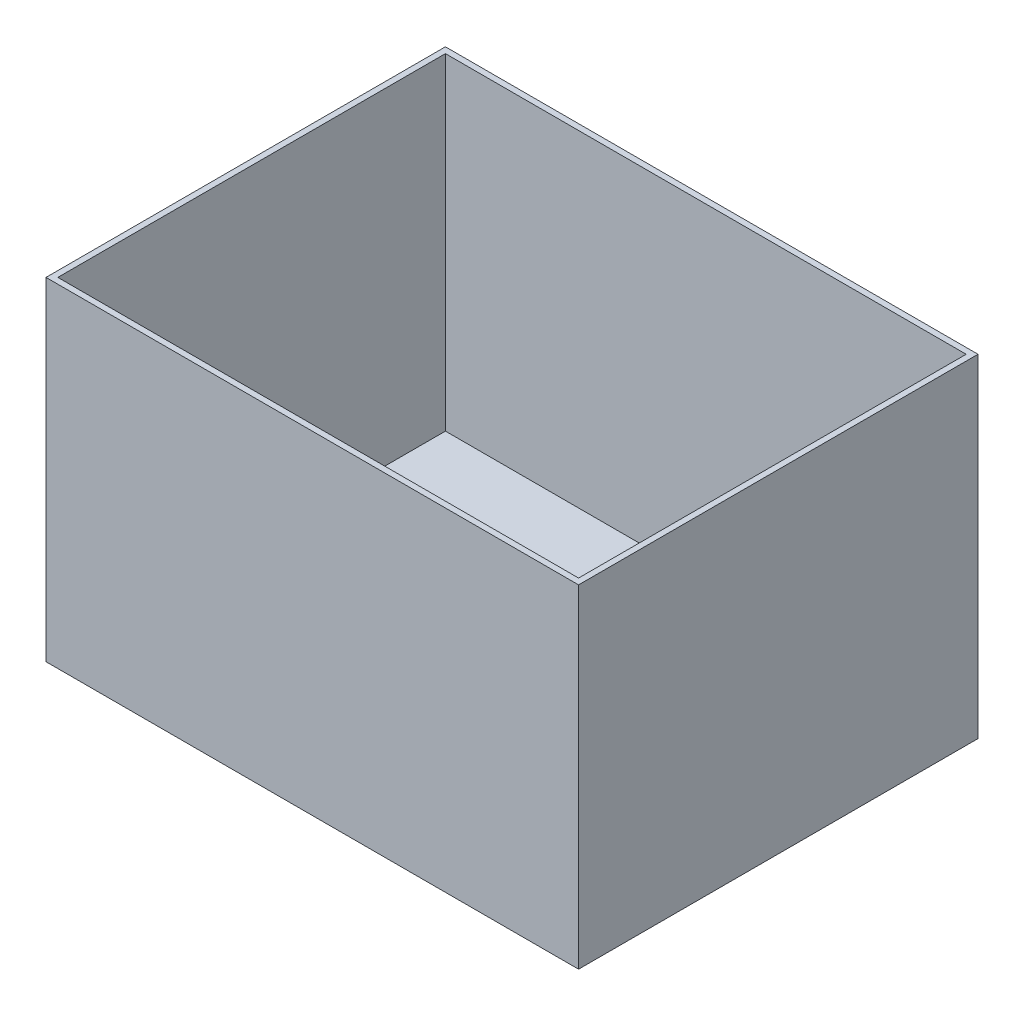
ISO-10303-21;
HEADER;
FILE_DESCRIPTION(('STEP AP214'),'2;1');
FILE_NAME('part.step','',(''),(''),'','','');
FILE_SCHEMA(('AUTOMOTIVE_DESIGN { 1 0 10303 214 1 1 1 1 }'));
ENDSEC;
DATA;
#1=APPLICATION_CONTEXT('core data for automotive mechanical design processes');
#2=APPLICATION_PROTOCOL_DEFINITION('international standard','automotive_design',2000,#1);
#3=PRODUCT_CONTEXT('',#1,'mechanical');
#4=PRODUCT('Part','Part','',(#3));
#5=PRODUCT_RELATED_PRODUCT_CATEGORY('part','',(#4));
#6=PRODUCT_DEFINITION_FORMATION('','',#4);
#7=PRODUCT_DEFINITION_CONTEXT('part definition',#1,'design');
#8=PRODUCT_DEFINITION('design','',#6,#7);
#9=PRODUCT_DEFINITION_SHAPE('','',#8);
#10=(LENGTH_UNIT() NAMED_UNIT(*) SI_UNIT(.MILLI.,.METRE.));
#11=(NAMED_UNIT(*) PLANE_ANGLE_UNIT() SI_UNIT($,.RADIAN.));
#12=(NAMED_UNIT(*) SI_UNIT($,.STERADIAN.) SOLID_ANGLE_UNIT());
#13=UNCERTAINTY_MEASURE_WITH_UNIT(LENGTH_MEASURE(1.E-05),#10,'distance_accuracy_value','');
#14=(GEOMETRIC_REPRESENTATION_CONTEXT(3) GLOBAL_UNCERTAINTY_ASSIGNED_CONTEXT((#13)) GLOBAL_UNIT_ASSIGNED_CONTEXT((#10,
#11,#12)) REPRESENTATION_CONTEXT('',''));
#15=CARTESIAN_POINT('',(0.,0.,0.));
#16=DIRECTION('',(0.,0.,1.));
#17=DIRECTION('',(1.,0.,0.));
#18=AXIS2_PLACEMENT_3D('',#15,#16,#17);
#19=CARTESIAN_POINT('',(180.,112.5,-135.));
#20=DIRECTION('',(1.,0.,0.));
#21=DIRECTION('',(0.,0.,-1.));
#22=AXIS2_PLACEMENT_3D('',#19,#20,#21);
#23=PLANE('',#22);
#24=DIRECTION('',(0.,0.,1.));
#25=VECTOR('',#24,1.);
#26=CARTESIAN_POINT('',(180.,112.5,-135.));
#27=LINE('',#26,#25);
#28=CARTESIAN_POINT('',(180.,112.5,-135.));
#29=VERTEX_POINT('',#28);
#30=CARTESIAN_POINT('',(180.,112.5,135.));
#31=VERTEX_POINT('',#30);
#32=EDGE_CURVE('E44',#29,#31,#27,.T.);
#33=ORIENTED_EDGE('',*,*,#32,.T.);
#34=DIRECTION('',(0.,1.,0.));
#35=VECTOR('',#34,1.);
#36=CARTESIAN_POINT('',(180.,112.5,135.));
#37=LINE('',#36,#35);
#38=CARTESIAN_POINT('',(180.,-112.5,135.));
#39=VERTEX_POINT('',#38);
#40=EDGE_CURVE('E116',#39,#31,#37,.T.);
#41=ORIENTED_EDGE('',*,*,#40,.F.);
#42=DIRECTION('',(0.,0.,1.));
#43=VECTOR('',#42,1.);
#44=CARTESIAN_POINT('',(180.,-112.5,-135.));
#45=LINE('',#44,#43);
#46=CARTESIAN_POINT('',(180.,-112.5,-135.));
#47=VERTEX_POINT('',#46);
#48=EDGE_CURVE('E11',#47,#39,#45,.T.);
#49=ORIENTED_EDGE('',*,*,#48,.F.);
#50=DIRECTION('',(0.,1.,0.));
#51=VECTOR('',#50,1.);
#52=CARTESIAN_POINT('',(180.,112.5,-135.));
#53=LINE('',#52,#51);
#54=EDGE_CURVE('E155',#47,#29,#53,.T.);
#55=ORIENTED_EDGE('',*,*,#54,.T.);
#56=EDGE_LOOP('',(#33,#41,#49,#55));
#57=FACE_BOUND('',#56,.T.);
#58=ADVANCED_FACE('F41',(#57),#23,.T.);
#59=CARTESIAN_POINT('',(-180.,-112.5,-135.));
#60=DIRECTION('',(0.,-1.,0.));
#61=DIRECTION('',(0.,0.,-1.));
#62=AXIS2_PLACEMENT_3D('',#59,#60,#61);
#63=PLANE('',#62);
#64=ORIENTED_EDGE('',*,*,#48,.T.);
#65=DIRECTION('',(1.,0.,0.));
#66=VECTOR('',#65,1.);
#67=CARTESIAN_POINT('',(-180.,-112.5,135.));
#68=LINE('',#67,#66);
#69=CARTESIAN_POINT('',(-180.,-112.5,135.));
#70=VERTEX_POINT('',#69);
#71=EDGE_CURVE('E152',#70,#39,#68,.T.);
#72=ORIENTED_EDGE('',*,*,#71,.F.);
#73=DIRECTION('',(0.,0.,1.));
#74=VECTOR('',#73,1.);
#75=CARTESIAN_POINT('',(-180.,-112.5,-135.));
#76=LINE('',#75,#74);
#77=CARTESIAN_POINT('',(-180.,-112.5,-135.));
#78=VERTEX_POINT('',#77);
#79=EDGE_CURVE('E49',#78,#70,#76,.T.);
#80=ORIENTED_EDGE('',*,*,#79,.F.);
#81=DIRECTION('',(1.,0.,0.));
#82=VECTOR('',#81,1.);
#83=CARTESIAN_POINT('',(-180.,-112.5,-135.));
#84=LINE('',#83,#82);
#85=EDGE_CURVE('E163',#78,#47,#84,.T.);
#86=ORIENTED_EDGE('',*,*,#85,.T.);
#87=EDGE_LOOP('',(#64,#72,#80,#86));
#88=FACE_BOUND('',#87,.T.);
#89=ADVANCED_FACE('F176',(#88),#63,.T.);
#90=CARTESIAN_POINT('',(-180.,112.5,-135.));
#91=DIRECTION('',(-1.,0.,0.));
#92=DIRECTION('',(0.,-1.,0.));
#93=AXIS2_PLACEMENT_3D('',#90,#91,#92);
#94=PLANE('',#93);
#95=ORIENTED_EDGE('',*,*,#79,.T.);
#96=DIRECTION('',(0.,-1.,0.));
#97=VECTOR('',#96,1.);
#98=CARTESIAN_POINT('',(-180.,112.5,135.));
#99=LINE('',#98,#97);
#100=CARTESIAN_POINT('',(-180.,112.5,135.));
#101=VERTEX_POINT('',#100);
#102=EDGE_CURVE('E149',#101,#70,#99,.T.);
#103=ORIENTED_EDGE('',*,*,#102,.F.);
#104=DIRECTION('',(0.,0.,1.));
#105=VECTOR('',#104,1.);
#106=CARTESIAN_POINT('',(-180.,112.5,-135.));
#107=LINE('',#106,#105);
#108=CARTESIAN_POINT('',(-180.,112.5,-135.));
#109=VERTEX_POINT('',#108);
#110=EDGE_CURVE('E166',#109,#101,#107,.T.);
#111=ORIENTED_EDGE('',*,*,#110,.F.);
#112=DIRECTION('',(0.,-1.,0.));
#113=VECTOR('',#112,1.);
#114=CARTESIAN_POINT('',(-180.,112.5,-135.));
#115=LINE('',#114,#113);
#116=EDGE_CURVE('E160',#109,#78,#115,.T.);
#117=ORIENTED_EDGE('',*,*,#116,.T.);
#118=EDGE_LOOP('',(#95,#103,#111,#117));
#119=FACE_BOUND('',#118,.T.);
#120=ADVANCED_FACE('F182',(#119),#94,.T.);
#121=CARTESIAN_POINT('',(-180.,112.5,-135.));
#122=DIRECTION('',(0.,1.,0.));
#123=DIRECTION('',(0.,0.,1.));
#124=AXIS2_PLACEMENT_3D('',#121,#122,#123);
#125=PLANE('',#124);
#126=DIRECTION('',(0.,0.,1.));
#127=VECTOR('',#126,1.);
#128=CARTESIAN_POINT('',(-176.,112.5,-135.));
#129=LINE('',#128,#127);
#130=CARTESIAN_POINT('',(-176.,112.5,-131.));
#131=VERTEX_POINT('',#130);
#132=CARTESIAN_POINT('',(-176.,112.5,131.));
#133=VERTEX_POINT('',#132);
#134=EDGE_CURVE('E129',#131,#133,#129,.T.);
#135=ORIENTED_EDGE('',*,*,#134,.F.);
#136=DIRECTION('',(-1.,0.,0.));
#137=VECTOR('',#136,1.);
#138=CARTESIAN_POINT('',(0.,112.5,-131.));
#139=LINE('',#138,#137);
#140=CARTESIAN_POINT('',(176.,112.5,-131.));
#141=VERTEX_POINT('',#140);
#142=EDGE_CURVE('E123',#141,#131,#139,.T.);
#143=ORIENTED_EDGE('',*,*,#142,.F.);
#144=DIRECTION('',(0.,0.,1.));
#145=VECTOR('',#144,1.);
#146=CARTESIAN_POINT('',(176.,112.5,-135.));
#147=LINE('',#146,#145);
#148=CARTESIAN_POINT('',(176.,112.5,131.));
#149=VERTEX_POINT('',#148);
#150=EDGE_CURVE('E121',#141,#149,#147,.T.);
#151=ORIENTED_EDGE('',*,*,#150,.T.);
#152=DIRECTION('',(-1.,0.,0.));
#153=VECTOR('',#152,1.);
#154=CARTESIAN_POINT('',(0.,112.5,131.));
#155=LINE('',#154,#153);
#156=EDGE_CURVE('E137',#149,#133,#155,.T.);
#157=ORIENTED_EDGE('',*,*,#156,.T.);
#158=EDGE_LOOP('',(#135,#143,#151,#157));
#159=FACE_BOUND('',#158,.T.);
#160=ORIENTED_EDGE('',*,*,#110,.T.);
#161=DIRECTION('',(-1.,0.,0.));
#162=VECTOR('',#161,1.);
#163=CARTESIAN_POINT('',(-180.,112.5,135.));
#164=LINE('',#163,#162);
#165=EDGE_CURVE('E146',#31,#101,#164,.T.);
#166=ORIENTED_EDGE('',*,*,#165,.F.);
#167=ORIENTED_EDGE('',*,*,#32,.F.);
#168=DIRECTION('',(-1.,0.,0.));
#169=VECTOR('',#168,1.);
#170=CARTESIAN_POINT('',(-180.,112.5,-135.));
#171=LINE('',#170,#169);
#172=EDGE_CURVE('E157',#29,#109,#171,.T.);
#173=ORIENTED_EDGE('',*,*,#172,.T.);
#174=EDGE_LOOP('',(#160,#166,#167,#173));
#175=FACE_BOUND('',#174,.T.);
#176=ADVANCED_FACE('F170',(#159,#175),#125,.T.);
#177=CARTESIAN_POINT('',(0.,0.,-135.));
#178=DIRECTION('',(0.,0.,1.));
#179=DIRECTION('',(1.,0.,0.));
#180=AXIS2_PLACEMENT_3D('',#177,#178,#179);
#181=PLANE('',#180);
#182=ORIENTED_EDGE('',*,*,#54,.F.);
#183=ORIENTED_EDGE('',*,*,#85,.F.);
#184=ORIENTED_EDGE('',*,*,#116,.F.);
#185=ORIENTED_EDGE('',*,*,#172,.F.);
#186=EDGE_LOOP('',(#182,#183,#184,#185));
#187=FACE_BOUND('',#186,.T.);
#188=ADVANCED_FACE('F180',(#187),#181,.F.);
#189=CARTESIAN_POINT('',(0.,0.,135.));
#190=DIRECTION('',(0.,0.,1.));
#191=DIRECTION('',(1.,0.,0.));
#192=AXIS2_PLACEMENT_3D('',#189,#190,#191);
#193=PLANE('',#192);
#194=ORIENTED_EDGE('',*,*,#40,.T.);
#195=ORIENTED_EDGE('',*,*,#165,.T.);
#196=ORIENTED_EDGE('',*,*,#102,.T.);
#197=ORIENTED_EDGE('',*,*,#71,.T.);
#198=EDGE_LOOP('',(#194,#195,#196,#197));
#199=FACE_BOUND('',#198,.T.);
#200=ADVANCED_FACE('F173',(#199),#193,.T.);
#201=CARTESIAN_POINT('',(176.,112.5,-135.));
#202=DIRECTION('',(1.,0.,0.));
#203=DIRECTION('',(0.,0.,-1.));
#204=AXIS2_PLACEMENT_3D('',#201,#202,#203);
#205=PLANE('',#204);
#206=ORIENTED_EDGE('',*,*,#150,.F.);
#207=DIRECTION('',(0.,1.,0.));
#208=VECTOR('',#207,1.);
#209=CARTESIAN_POINT('',(176.,0.,-131.));
#210=LINE('',#209,#208);
#211=CARTESIAN_POINT('',(176.,-108.5,-131.));
#212=VERTEX_POINT('',#211);
#213=EDGE_CURVE('E57',#212,#141,#210,.T.);
#214=ORIENTED_EDGE('',*,*,#213,.F.);
#215=DIRECTION('',(0.,0.,1.));
#216=VECTOR('',#215,1.);
#217=CARTESIAN_POINT('',(176.,-108.5,-135.));
#218=LINE('',#217,#216);
#219=CARTESIAN_POINT('',(176.,-108.5,131.));
#220=VERTEX_POINT('',#219);
#221=EDGE_CURVE('E108',#212,#220,#218,.T.);
#222=ORIENTED_EDGE('',*,*,#221,.T.);
#223=DIRECTION('',(0.,1.,0.));
#224=VECTOR('',#223,1.);
#225=CARTESIAN_POINT('',(176.,0.,131.));
#226=LINE('',#225,#224);
#227=EDGE_CURVE('E143',#220,#149,#226,.T.);
#228=ORIENTED_EDGE('',*,*,#227,.T.);
#229=EDGE_LOOP('',(#206,#214,#222,#228));
#230=FACE_BOUND('',#229,.T.);
#231=ADVANCED_FACE('F119',(#230),#205,.F.);
#232=CARTESIAN_POINT('',(-180.,-108.5,-135.));
#233=DIRECTION('',(0.,-1.,0.));
#234=DIRECTION('',(0.,0.,-1.));
#235=AXIS2_PLACEMENT_3D('',#232,#233,#234);
#236=PLANE('',#235);
#237=ORIENTED_EDGE('',*,*,#221,.F.);
#238=DIRECTION('',(1.,0.,0.));
#239=VECTOR('',#238,1.);
#240=CARTESIAN_POINT('',(0.,-108.5,-131.));
#241=LINE('',#240,#239);
#242=CARTESIAN_POINT('',(-176.,-108.5,-131.));
#243=VERTEX_POINT('',#242);
#244=EDGE_CURVE('E110',#243,#212,#241,.T.);
#245=ORIENTED_EDGE('',*,*,#244,.F.);
#246=DIRECTION('',(0.,0.,1.));
#247=VECTOR('',#246,1.);
#248=CARTESIAN_POINT('',(-176.,-108.5,-135.));
#249=LINE('',#248,#247);
#250=CARTESIAN_POINT('',(-176.,-108.5,131.));
#251=VERTEX_POINT('',#250);
#252=EDGE_CURVE('E117',#243,#251,#249,.T.);
#253=ORIENTED_EDGE('',*,*,#252,.T.);
#254=DIRECTION('',(1.,0.,0.));
#255=VECTOR('',#254,1.);
#256=CARTESIAN_POINT('',(0.,-108.5,131.));
#257=LINE('',#256,#255);
#258=EDGE_CURVE('E112',#251,#220,#257,.T.);
#259=ORIENTED_EDGE('',*,*,#258,.T.);
#260=EDGE_LOOP('',(#237,#245,#253,#259));
#261=FACE_BOUND('',#260,.T.);
#262=ADVANCED_FACE('F109',(#261),#236,.F.);
#263=CARTESIAN_POINT('',(-176.,112.5,-135.));
#264=DIRECTION('',(-1.,0.,0.));
#265=DIRECTION('',(0.,-1.,0.));
#266=AXIS2_PLACEMENT_3D('',#263,#264,#265);
#267=PLANE('',#266);
#268=ORIENTED_EDGE('',*,*,#252,.F.);
#269=DIRECTION('',(0.,-1.,0.));
#270=VECTOR('',#269,1.);
#271=CARTESIAN_POINT('',(-176.,0.,-131.));
#272=LINE('',#271,#270);
#273=EDGE_CURVE('E127',#131,#243,#272,.T.);
#274=ORIENTED_EDGE('',*,*,#273,.F.);
#275=ORIENTED_EDGE('',*,*,#134,.T.);
#276=DIRECTION('',(0.,-1.,0.));
#277=VECTOR('',#276,1.);
#278=CARTESIAN_POINT('',(-176.,0.,131.));
#279=LINE('',#278,#277);
#280=EDGE_CURVE('E135',#133,#251,#279,.T.);
#281=ORIENTED_EDGE('',*,*,#280,.T.);
#282=EDGE_LOOP('',(#268,#274,#275,#281));
#283=FACE_BOUND('',#282,.T.);
#284=ADVANCED_FACE('F243',(#283),#267,.F.);
#285=CARTESIAN_POINT('',(0.,0.,-131.));
#286=DIRECTION('',(0.,0.,1.));
#287=DIRECTION('',(1.,0.,0.));
#288=AXIS2_PLACEMENT_3D('',#285,#286,#287);
#289=PLANE('',#288);
#290=ORIENTED_EDGE('',*,*,#213,.T.);
#291=ORIENTED_EDGE('',*,*,#142,.T.);
#292=ORIENTED_EDGE('',*,*,#273,.T.);
#293=ORIENTED_EDGE('',*,*,#244,.T.);
#294=EDGE_LOOP('',(#290,#291,#292,#293));
#295=FACE_BOUND('',#294,.T.);
#296=ADVANCED_FACE('F126',(#295),#289,.T.);
#297=CARTESIAN_POINT('',(0.,0.,131.));
#298=DIRECTION('',(0.,0.,1.));
#299=DIRECTION('',(1.,0.,0.));
#300=AXIS2_PLACEMENT_3D('',#297,#298,#299);
#301=PLANE('',#300);
#302=ORIENTED_EDGE('',*,*,#227,.F.);
#303=ORIENTED_EDGE('',*,*,#258,.F.);
#304=ORIENTED_EDGE('',*,*,#280,.F.);
#305=ORIENTED_EDGE('',*,*,#156,.F.);
#306=EDGE_LOOP('',(#302,#303,#304,#305));
#307=FACE_BOUND('',#306,.T.);
#308=ADVANCED_FACE('F261',(#307),#301,.F.);
#309=CLOSED_SHELL('',(#58,#89,#120,#176,#188,#200,#231,#262,#284,#296,#308));
#310=MANIFOLD_SOLID_BREP('B2',#309);
#311=ADVANCED_BREP_SHAPE_REPRESENTATION('',(#18,#310),#14);
#312=SHAPE_DEFINITION_REPRESENTATION(#9,#311);
ENDSEC;
END-ISO-10303-21;
